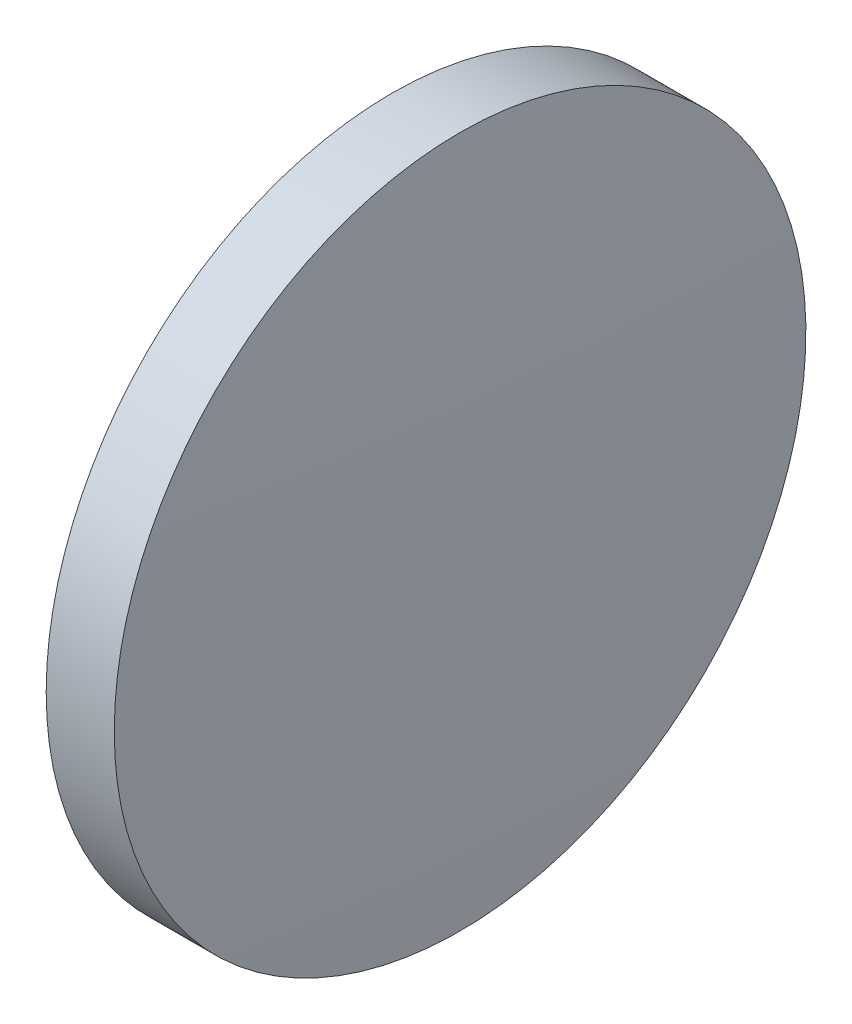
ISO-10303-21;
HEADER;
FILE_DESCRIPTION(('STEP AP214'),'2;1');
FILE_NAME('part.step','',(''),(''),'','','');
FILE_SCHEMA(('AUTOMOTIVE_DESIGN { 1 0 10303 214 1 1 1 1 }'));
ENDSEC;
DATA;
#1=APPLICATION_CONTEXT('core data for automotive mechanical design processes');
#2=APPLICATION_PROTOCOL_DEFINITION('international standard','automotive_design',2000,#1);
#3=PRODUCT_CONTEXT('',#1,'mechanical');
#4=PRODUCT('Part','Part','',(#3));
#5=PRODUCT_RELATED_PRODUCT_CATEGORY('part','',(#4));
#6=PRODUCT_DEFINITION_FORMATION('','',#4);
#7=PRODUCT_DEFINITION_CONTEXT('part definition',#1,'design');
#8=PRODUCT_DEFINITION('design','',#6,#7);
#9=PRODUCT_DEFINITION_SHAPE('','',#8);
#10=(LENGTH_UNIT() NAMED_UNIT(*) SI_UNIT(.MILLI.,.METRE.));
#11=(NAMED_UNIT(*) PLANE_ANGLE_UNIT() SI_UNIT($,.RADIAN.));
#12=(NAMED_UNIT(*) SI_UNIT($,.STERADIAN.) SOLID_ANGLE_UNIT());
#13=UNCERTAINTY_MEASURE_WITH_UNIT(LENGTH_MEASURE(1.E-05),#10,'distance_accuracy_value','');
#14=(GEOMETRIC_REPRESENTATION_CONTEXT(3) GLOBAL_UNCERTAINTY_ASSIGNED_CONTEXT((#13)) GLOBAL_UNIT_ASSIGNED_CONTEXT((#10,
#11,#12)) REPRESENTATION_CONTEXT('',''));
#15=CARTESIAN_POINT('',(0.,0.,0.));
#16=DIRECTION('',(0.,0.,1.));
#17=DIRECTION('',(1.,0.,0.));
#18=AXIS2_PLACEMENT_3D('',#15,#16,#17);
#19=CARTESIAN_POINT('',(358.472061142559,48.616113023184,0.));
#20=DIRECTION('',(-1.,0.,0.));
#21=DIRECTION('',(0.,1.,0.));
#22=AXIS2_PLACEMENT_3D('',#19,#20,#21);
#23=SPHERICAL_SURFACE('',#22,273.558825180431);
#24=CARTESIAN_POINT('',(85.2081944603768,48.6161130231848,0.));
#25=DIRECTION('',(-1.,0.,0.));
#26=DIRECTION('',(0.,0.,1.));
#27=AXIS2_PLACEMENT_3D('',#24,#25,#26);
#28=CIRCLE('',#27,12.7);
#29=CARTESIAN_POINT('',(85.2081944603768,48.6161130231848,12.7));
#30=VERTEX_POINT('',#29);
#31=EDGE_CURVE('E46',#30,#30,#28,.T.);
#32=ORIENTED_EDGE('',*,*,#31,.T.);
#33=EDGE_LOOP('',(#32));
#34=FACE_BOUND('',#33,.T.);
#35=ADVANCED_FACE('F39',(#34),#23,.T.);
#36=CARTESIAN_POINT('',(-185.55567359322,48.6161130231848,0.));
#37=DIRECTION('',(-1.,0.,0.));
#38=DIRECTION('',(0.,1.,0.));
#39=AXIS2_PLACEMENT_3D('',#36,#37,#38);
#40=SPHERICAL_SURFACE('',#39,273.558825180416);
#41=CARTESIAN_POINT('',(87.7081930889482,48.6161130231848,0.));
#42=DIRECTION('',(-1.,0.,0.));
#43=DIRECTION('',(0.,0.,1.));
#44=AXIS2_PLACEMENT_3D('',#41,#42,#43);
#45=CIRCLE('',#44,12.7);
#46=CARTESIAN_POINT('',(87.7081930889482,48.6161130231848,12.7));
#47=VERTEX_POINT('',#46);
#48=EDGE_CURVE('E10',#47,#47,#45,.T.);
#49=ORIENTED_EDGE('',*,*,#48,.F.);
#50=EDGE_LOOP('',(#49));
#51=FACE_BOUND('',#50,.T.);
#52=ADVANCED_FACE('F56',(#51),#40,.T.);
#53=CARTESIAN_POINT('',(83.3719810515267,48.6161130231848,0.));
#54=DIRECTION('',(-1.,0.,0.));
#55=DIRECTION('',(0.,0.,1.));
#56=AXIS2_PLACEMENT_3D('',#53,#54,#55);
#57=CYLINDRICAL_SURFACE('',#56,12.7);
#58=ORIENTED_EDGE('',*,*,#48,.T.);
#59=EDGE_LOOP('',(#58));
#60=FACE_BOUND('',#59,.T.);
#61=ORIENTED_EDGE('',*,*,#31,.F.);
#62=EDGE_LOOP('',(#61));
#63=FACE_BOUND('',#62,.T.);
#64=ADVANCED_FACE('F54',(#60,#63),#57,.T.);
#65=CLOSED_SHELL('',(#35,#52,#64));
#66=MANIFOLD_SOLID_BREP('B2',#65);
#67=ADVANCED_BREP_SHAPE_REPRESENTATION('',(#18,#66),#14);
#68=SHAPE_DEFINITION_REPRESENTATION(#9,#67);
ENDSEC;
END-ISO-10303-21;
